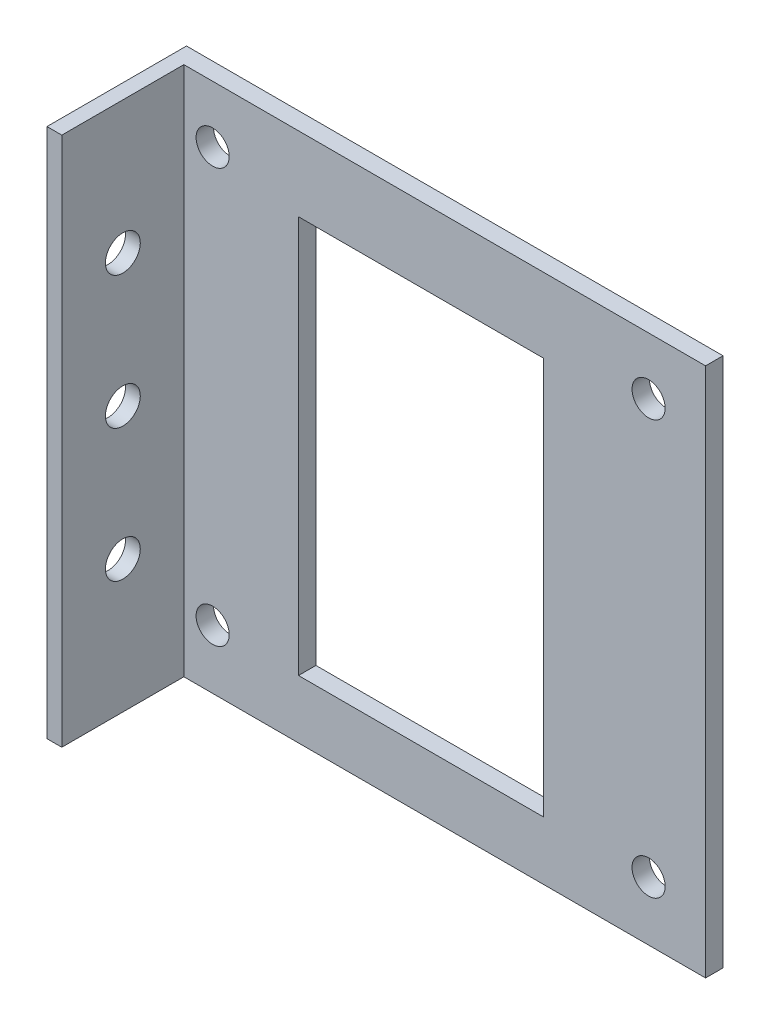
ISO-10303-21;
HEADER;
FILE_DESCRIPTION(('STEP AP214'),'2;1');
FILE_NAME('part.step','',(''),(''),'','','');
FILE_SCHEMA(('AUTOMOTIVE_DESIGN { 1 0 10303 214 1 1 1 1 }'));
ENDSEC;
DATA;
#1=APPLICATION_CONTEXT('core data for automotive mechanical design processes');
#2=APPLICATION_PROTOCOL_DEFINITION('international standard','automotive_design',2000,#1);
#3=PRODUCT_CONTEXT('',#1,'mechanical');
#4=PRODUCT('Part','Part','',(#3));
#5=PRODUCT_RELATED_PRODUCT_CATEGORY('part','',(#4));
#6=PRODUCT_DEFINITION_FORMATION('','',#4);
#7=PRODUCT_DEFINITION_CONTEXT('part definition',#1,'design');
#8=PRODUCT_DEFINITION('design','',#6,#7);
#9=PRODUCT_DEFINITION_SHAPE('','',#8);
#10=(LENGTH_UNIT() NAMED_UNIT(*) SI_UNIT(.MILLI.,.METRE.));
#11=(NAMED_UNIT(*) PLANE_ANGLE_UNIT() SI_UNIT($,.RADIAN.));
#12=(NAMED_UNIT(*) SI_UNIT($,.STERADIAN.) SOLID_ANGLE_UNIT());
#13=UNCERTAINTY_MEASURE_WITH_UNIT(LENGTH_MEASURE(1.E-05),#10,'distance_accuracy_value','');
#14=(GEOMETRIC_REPRESENTATION_CONTEXT(3) GLOBAL_UNCERTAINTY_ASSIGNED_CONTEXT((#13)) GLOBAL_UNIT_ASSIGNED_CONTEXT((#10,
#11,#12)) REPRESENTATION_CONTEXT('',''));
#15=CARTESIAN_POINT('',(0.,0.,0.));
#16=DIRECTION('',(0.,0.,1.));
#17=DIRECTION('',(1.,0.,0.));
#18=AXIS2_PLACEMENT_3D('',#15,#16,#17);
#19=CARTESIAN_POINT('',(0.,0.,2.54));
#20=DIRECTION('',(0.,0.,1.));
#21=DIRECTION('',(1.,0.,0.));
#22=AXIS2_PLACEMENT_3D('',#19,#20,#21);
#23=PLANE('',#22);
#24=DIRECTION('',(0.,1.,0.));
#25=VECTOR('',#24,1.);
#26=CARTESIAN_POINT('',(-30.4281386564607,30.9740668549754,2.54));
#27=LINE('',#26,#25);
#28=CARTESIAN_POINT('',(-30.4281386564607,-46.2479215736483,2.54));
#29=VERTEX_POINT('',#28);
#30=CARTESIAN_POINT('',(-30.4281386564607,30.9740668549754,2.54));
#31=VERTEX_POINT('',#30);
#32=EDGE_CURVE('E48',#29,#31,#27,.T.);
#33=ORIENTED_EDGE('',*,*,#32,.F.);
#34=DIRECTION('',(1.,0.,0.));
#35=VECTOR('',#34,1.);
#36=CARTESIAN_POINT('',(-32.5877369330817,-46.2479215736483,2.54));
#37=LINE('',#36,#35);
#38=CARTESIAN_POINT('',(45.5627179981381,-46.2479215736483,2.54));
#39=VERTEX_POINT('',#38);
#40=EDGE_CURVE('E195',#29,#39,#37,.T.);
#41=ORIENTED_EDGE('',*,*,#40,.T.);
#42=DIRECTION('',(0.,1.,0.));
#43=VECTOR('',#42,1.);
#44=CARTESIAN_POINT('',(45.5627179981381,30.9740668549754,2.54));
#45=LINE('',#44,#43);
#46=CARTESIAN_POINT('',(45.5627179981381,30.9740668549754,2.54));
#47=VERTEX_POINT('',#46);
#48=EDGE_CURVE('E197',#39,#47,#45,.T.);
#49=ORIENTED_EDGE('',*,*,#48,.T.);
#50=DIRECTION('',(-1.,0.,0.));
#51=VECTOR('',#50,1.);
#52=CARTESIAN_POINT('',(-32.5877369330817,30.9740668549754,2.54));
#53=LINE('',#52,#51);
#54=EDGE_CURVE('E200',#47,#31,#53,.T.);
#55=ORIENTED_EDGE('',*,*,#54,.T.);
#56=EDGE_LOOP('',(#33,#41,#49,#55));
#57=FACE_BOUND('',#56,.T.);
#58=CARTESIAN_POINT('',(-26.2377369595064,-37.6485441198693,2.54));
#59=DIRECTION('',(0.,0.,1.));
#60=DIRECTION('',(1.,0.,0.));
#61=AXIS2_PLACEMENT_3D('',#58,#59,#60);
#62=CIRCLE('',#61,2.41300000000534);
#63=CARTESIAN_POINT('',(-23.8247369595011,-37.6485441198693,2.54));
#64=VERTEX_POINT('',#63);
#65=EDGE_CURVE('E178',#64,#64,#62,.T.);
#66=ORIENTED_EDGE('',*,*,#65,.F.);
#67=EDGE_LOOP('',(#66));
#68=FACE_BOUND('',#67,.T.);
#69=CARTESIAN_POINT('',(37.2622630404935,22.6764558801306,2.54));
#70=DIRECTION('',(0.,0.,1.));
#71=DIRECTION('',(1.,0.,0.));
#72=AXIS2_PLACEMENT_3D('',#69,#70,#71);
#73=CIRCLE('',#72,2.41299999998956);
#74=CARTESIAN_POINT('',(39.6752630404831,22.6764558801306,2.54));
#75=VERTEX_POINT('',#74);
#76=EDGE_CURVE('E190',#75,#75,#73,.T.);
#77=ORIENTED_EDGE('',*,*,#76,.F.);
#78=EDGE_LOOP('',(#77));
#79=FACE_BOUND('',#78,.T.);
#80=CARTESIAN_POINT('',(37.2622630404935,-37.6485441198693,2.54));
#81=DIRECTION('',(0.,0.,1.));
#82=DIRECTION('',(1.,0.,0.));
#83=AXIS2_PLACEMENT_3D('',#80,#81,#82);
#84=CIRCLE('',#83,2.41300000000643);
#85=CARTESIAN_POINT('',(39.6752630405,-37.6485441198693,2.54));
#86=VERTEX_POINT('',#85);
#87=EDGE_CURVE('E184',#86,#86,#84,.T.);
#88=ORIENTED_EDGE('',*,*,#87,.F.);
#89=EDGE_LOOP('',(#88));
#90=FACE_BOUND('',#89,.T.);
#91=CARTESIAN_POINT('',(-26.2377369595064,22.6764558801306,2.54));
#92=DIRECTION('',(0.,0.,1.));
#93=DIRECTION('',(1.,0.,0.));
#94=AXIS2_PLACEMENT_3D('',#91,#92,#93);
#95=CIRCLE('',#94,2.41299999993067);
#96=CARTESIAN_POINT('',(-23.8247369595758,22.6764558801306,2.54));
#97=VERTEX_POINT('',#96);
#98=EDGE_CURVE('E172',#97,#97,#95,.T.);
#99=ORIENTED_EDGE('',*,*,#98,.F.);
#100=EDGE_LOOP('',(#99));
#101=FACE_BOUND('',#100,.T.);
#102=DIRECTION('',(-1.,0.,0.));
#103=VECTOR('',#102,1.);
#104=CARTESIAN_POINT('',(21.9184982405309,20.1358999691804,2.54));
#105=LINE('',#104,#103);
#106=CARTESIAN_POINT('',(21.9184982405309,20.1358999691804,2.54));
#107=VERTEX_POINT('',#106);
#108=CARTESIAN_POINT('',(-13.734240403043,20.1358999691804,2.54));
#109=VERTEX_POINT('',#108);
#110=EDGE_CURVE('E145',#107,#109,#105,.T.);
#111=ORIENTED_EDGE('',*,*,#110,.F.);
#112=DIRECTION('',(0.,1.,0.));
#113=VECTOR('',#112,1.);
#114=CARTESIAN_POINT('',(21.9184982405309,-37.7383856681526,2.54));
#115=LINE('',#114,#113);
#116=CARTESIAN_POINT('',(21.9184982405309,-37.7383856681526,2.54));
#117=VERTEX_POINT('',#116);
#118=EDGE_CURVE('E143',#117,#107,#115,.T.);
#119=ORIENTED_EDGE('',*,*,#118,.F.);
#120=DIRECTION('',(1.,0.,0.));
#121=VECTOR('',#120,1.);
#122=CARTESIAN_POINT('',(21.9184982405309,-37.7383856681526,2.54));
#123=LINE('',#122,#121);
#124=CARTESIAN_POINT('',(-13.734240403043,-37.7383856681526,2.54));
#125=VERTEX_POINT('',#124);
#126=EDGE_CURVE('E150',#125,#117,#123,.T.);
#127=ORIENTED_EDGE('',*,*,#126,.F.);
#128=DIRECTION('',(0.,-1.,0.));
#129=VECTOR('',#128,1.);
#130=CARTESIAN_POINT('',(-13.734240403043,-37.7383856681526,2.54));
#131=LINE('',#130,#129);
#132=EDGE_CURVE('E148',#109,#125,#131,.T.);
#133=ORIENTED_EDGE('',*,*,#132,.F.);
#134=EDGE_LOOP('',(#111,#119,#127,#133));
#135=FACE_BOUND('',#134,.T.);
#136=ADVANCED_FACE('F33',(#57,#68,#79,#90,#101,#135),#23,.T.);
#137=CARTESIAN_POINT('',(0.,0.,0.));
#138=DIRECTION('',(0.,0.,1.));
#139=DIRECTION('',(1.,0.,0.));
#140=AXIS2_PLACEMENT_3D('',#137,#138,#139);
#141=PLANE('',#140);
#142=CARTESIAN_POINT('',(-26.2377369595064,22.6764558801306,0.));
#143=DIRECTION('',(0.,0.,1.));
#144=DIRECTION('',(1.,0.,0.));
#145=AXIS2_PLACEMENT_3D('',#142,#143,#144);
#146=CIRCLE('',#145,2.41299999993067);
#147=CARTESIAN_POINT('',(-23.8247369595758,22.6764558801306,0.));
#148=VERTEX_POINT('',#147);
#149=EDGE_CURVE('E171',#148,#148,#146,.T.);
#150=ORIENTED_EDGE('',*,*,#149,.T.);
#151=EDGE_LOOP('',(#150));
#152=FACE_BOUND('',#151,.T.);
#153=CARTESIAN_POINT('',(-26.2377369595064,-37.6485441198693,0.));
#154=DIRECTION('',(0.,0.,1.));
#155=DIRECTION('',(1.,0.,0.));
#156=AXIS2_PLACEMENT_3D('',#153,#154,#155);
#157=CIRCLE('',#156,2.41300000000534);
#158=CARTESIAN_POINT('',(-23.8247369595011,-37.6485441198693,0.));
#159=VERTEX_POINT('',#158);
#160=EDGE_CURVE('E175',#159,#159,#157,.T.);
#161=ORIENTED_EDGE('',*,*,#160,.T.);
#162=EDGE_LOOP('',(#161));
#163=FACE_BOUND('',#162,.T.);
#164=CARTESIAN_POINT('',(37.2622630404935,-37.6485441198693,0.));
#165=DIRECTION('',(0.,0.,1.));
#166=DIRECTION('',(1.,0.,0.));
#167=AXIS2_PLACEMENT_3D('',#164,#165,#166);
#168=CIRCLE('',#167,2.41300000000643);
#169=CARTESIAN_POINT('',(39.6752630405,-37.6485441198693,0.));
#170=VERTEX_POINT('',#169);
#171=EDGE_CURVE('E181',#170,#170,#168,.T.);
#172=ORIENTED_EDGE('',*,*,#171,.T.);
#173=EDGE_LOOP('',(#172));
#174=FACE_BOUND('',#173,.T.);
#175=CARTESIAN_POINT('',(37.2622630404935,22.6764558801306,0.));
#176=DIRECTION('',(0.,0.,1.));
#177=DIRECTION('',(1.,0.,0.));
#178=AXIS2_PLACEMENT_3D('',#175,#176,#177);
#179=CIRCLE('',#178,2.41299999998956);
#180=CARTESIAN_POINT('',(39.6752630404831,22.6764558801306,0.));
#181=VERTEX_POINT('',#180);
#182=EDGE_CURVE('E187',#181,#181,#179,.T.);
#183=ORIENTED_EDGE('',*,*,#182,.T.);
#184=EDGE_LOOP('',(#183));
#185=FACE_BOUND('',#184,.T.);
#186=DIRECTION('',(0.,-1.,0.));
#187=VECTOR('',#186,1.);
#188=CARTESIAN_POINT('',(-32.5877369330817,30.9740668549754,0.));
#189=LINE('',#188,#187);
#190=CARTESIAN_POINT('',(-32.5877369330817,30.9740668549754,0.));
#191=VERTEX_POINT('',#190);
#192=CARTESIAN_POINT('',(-32.5877369330817,-46.2479215736483,0.));
#193=VERTEX_POINT('',#192);
#194=EDGE_CURVE('E115',#191,#193,#189,.T.);
#195=ORIENTED_EDGE('',*,*,#194,.F.);
#196=DIRECTION('',(-1.,0.,0.));
#197=VECTOR('',#196,1.);
#198=CARTESIAN_POINT('',(-32.5877369330817,30.9740668549754,0.));
#199=LINE('',#198,#197);
#200=CARTESIAN_POINT('',(45.5627179981381,30.9740668549754,0.));
#201=VERTEX_POINT('',#200);
#202=EDGE_CURVE('E198',#201,#191,#199,.T.);
#203=ORIENTED_EDGE('',*,*,#202,.F.);
#204=DIRECTION('',(0.,1.,0.));
#205=VECTOR('',#204,1.);
#206=CARTESIAN_POINT('',(45.5627179981381,30.9740668549754,0.));
#207=LINE('',#206,#205);
#208=CARTESIAN_POINT('',(45.5627179981381,-46.2479215736483,0.));
#209=VERTEX_POINT('',#208);
#210=EDGE_CURVE('E206',#209,#201,#207,.T.);
#211=ORIENTED_EDGE('',*,*,#210,.F.);
#212=DIRECTION('',(1.,0.,0.));
#213=VECTOR('',#212,1.);
#214=CARTESIAN_POINT('',(-32.5877369330817,-46.2479215736483,0.));
#215=LINE('',#214,#213);
#216=EDGE_CURVE('E204',#193,#209,#215,.T.);
#217=ORIENTED_EDGE('',*,*,#216,.F.);
#218=EDGE_LOOP('',(#195,#203,#211,#217));
#219=FACE_BOUND('',#218,.T.);
#220=DIRECTION('',(0.,1.,0.));
#221=VECTOR('',#220,1.);
#222=CARTESIAN_POINT('',(21.9184982405309,-37.7383856681526,0.));
#223=LINE('',#222,#221);
#224=CARTESIAN_POINT('',(21.9184982405309,-37.7383856681526,0.));
#225=VERTEX_POINT('',#224);
#226=CARTESIAN_POINT('',(21.9184982405309,20.1358999691804,0.));
#227=VERTEX_POINT('',#226);
#228=EDGE_CURVE('E142',#225,#227,#223,.T.);
#229=ORIENTED_EDGE('',*,*,#228,.T.);
#230=DIRECTION('',(-1.,0.,0.));
#231=VECTOR('',#230,1.);
#232=CARTESIAN_POINT('',(21.9184982405309,20.1358999691804,0.));
#233=LINE('',#232,#231);
#234=CARTESIAN_POINT('',(-13.734240403043,20.1358999691804,0.));
#235=VERTEX_POINT('',#234);
#236=EDGE_CURVE('E155',#227,#235,#233,.T.);
#237=ORIENTED_EDGE('',*,*,#236,.T.);
#238=DIRECTION('',(0.,-1.,0.));
#239=VECTOR('',#238,1.);
#240=CARTESIAN_POINT('',(-13.734240403043,-37.7383856681526,0.));
#241=LINE('',#240,#239);
#242=CARTESIAN_POINT('',(-13.734240403043,-37.7383856681526,0.));
#243=VERTEX_POINT('',#242);
#244=EDGE_CURVE('E158',#235,#243,#241,.T.);
#245=ORIENTED_EDGE('',*,*,#244,.T.);
#246=DIRECTION('',(1.,0.,0.));
#247=VECTOR('',#246,1.);
#248=CARTESIAN_POINT('',(21.9184982405309,-37.7383856681526,0.));
#249=LINE('',#248,#247);
#250=EDGE_CURVE('E146',#243,#225,#249,.T.);
#251=ORIENTED_EDGE('',*,*,#250,.T.);
#252=EDGE_LOOP('',(#229,#237,#245,#251));
#253=FACE_BOUND('',#252,.T.);
#254=ADVANCED_FACE('F221',(#152,#163,#174,#185,#219,#253),#141,.F.);
#255=CARTESIAN_POINT('',(-32.5877369330817,30.9740668549754,2.54));
#256=DIRECTION('',(1.,0.,0.));
#257=DIRECTION('',(0.,1.,0.));
#258=AXIS2_PLACEMENT_3D('',#255,#256,#257);
#259=PLANE('',#258);
#260=CARTESIAN_POINT('',(-32.5877369330817,-26.9424244664924,11.43));
#261=DIRECTION('',(1.,0.,0.));
#262=DIRECTION('',(0.,1.,0.));
#263=AXIS2_PLACEMENT_3D('',#260,#261,#262);
#264=CIRCLE('',#263,2.54);
#265=CARTESIAN_POINT('',(-32.5877369330817,-24.4024244664924,11.43));
#266=VERTEX_POINT('',#265);
#267=EDGE_CURVE('E131',#266,#266,#264,.T.);
#268=ORIENTED_EDGE('',*,*,#267,.T.);
#269=EDGE_LOOP('',(#268));
#270=FACE_BOUND('',#269,.T.);
#271=CARTESIAN_POINT('',(-32.5877369330817,11.6685697478194,11.43));
#272=DIRECTION('',(1.,0.,0.));
#273=DIRECTION('',(0.,1.,0.));
#274=AXIS2_PLACEMENT_3D('',#271,#272,#273);
#275=CIRCLE('',#274,2.54);
#276=CARTESIAN_POINT('',(-32.5877369330817,14.2085697478194,11.43));
#277=VERTEX_POINT('',#276);
#278=EDGE_CURVE('E271',#277,#277,#275,.T.);
#279=ORIENTED_EDGE('',*,*,#278,.T.);
#280=EDGE_LOOP('',(#279));
#281=FACE_BOUND('',#280,.T.);
#282=CARTESIAN_POINT('',(-32.5877369330817,-7.63692735933649,11.43));
#283=DIRECTION('',(1.,0.,0.));
#284=DIRECTION('',(0.,1.,0.));
#285=AXIS2_PLACEMENT_3D('',#282,#283,#284);
#286=CIRCLE('',#285,2.54);
#287=CARTESIAN_POINT('',(-32.5877369330817,-5.09692735933649,11.43));
#288=VERTEX_POINT('',#287);
#289=EDGE_CURVE('E274',#288,#288,#286,.T.);
#290=ORIENTED_EDGE('',*,*,#289,.T.);
#291=EDGE_LOOP('',(#290));
#292=FACE_BOUND('',#291,.T.);
#293=ORIENTED_EDGE('',*,*,#194,.T.);
#294=DIRECTION('',(0.,0.,-1.));
#295=VECTOR('',#294,1.);
#296=CARTESIAN_POINT('',(-32.5877369330817,-46.2479215736483,2.54));
#297=LINE('',#296,#295);
#298=CARTESIAN_POINT('',(-32.5877369330817,-46.2479215736483,20.32));
#299=VERTEX_POINT('',#298);
#300=EDGE_CURVE('E11',#299,#193,#297,.T.);
#301=ORIENTED_EDGE('',*,*,#300,.F.);
#302=DIRECTION('',(0.,-1.,0.));
#303=VECTOR('',#302,1.);
#304=CARTESIAN_POINT('',(-32.5877369330817,30.9740668549754,20.32));
#305=LINE('',#304,#303);
#306=CARTESIAN_POINT('',(-32.5877369330817,30.9740668549754,20.32));
#307=VERTEX_POINT('',#306);
#308=EDGE_CURVE('E113',#307,#299,#305,.T.);
#309=ORIENTED_EDGE('',*,*,#308,.F.);
#310=DIRECTION('',(0.,0.,-1.));
#311=VECTOR('',#310,1.);
#312=CARTESIAN_POINT('',(-32.5877369330817,30.9740668549754,2.54));
#313=LINE('',#312,#311);
#314=EDGE_CURVE('E202',#307,#191,#313,.T.);
#315=ORIENTED_EDGE('',*,*,#314,.T.);
#316=EDGE_LOOP('',(#293,#301,#309,#315));
#317=FACE_BOUND('',#316,.T.);
#318=ADVANCED_FACE('F35',(#270,#281,#292,#317),#259,.F.);
#319=CARTESIAN_POINT('',(-32.5877369330817,-46.2479215736483,2.54));
#320=DIRECTION('',(0.,1.,0.));
#321=DIRECTION('',(0.,0.,1.));
#322=AXIS2_PLACEMENT_3D('',#319,#320,#321);
#323=PLANE('',#322);
#324=ORIENTED_EDGE('',*,*,#216,.T.);
#325=DIRECTION('',(0.,0.,-1.));
#326=VECTOR('',#325,1.);
#327=CARTESIAN_POINT('',(45.5627179981381,-46.2479215736483,2.54));
#328=LINE('',#327,#326);
#329=EDGE_CURVE('E41',#39,#209,#328,.T.);
#330=ORIENTED_EDGE('',*,*,#329,.F.);
#331=ORIENTED_EDGE('',*,*,#40,.F.);
#332=DIRECTION('',(0.,0.,-1.));
#333=VECTOR('',#332,1.);
#334=CARTESIAN_POINT('',(-30.4281386564607,-46.2479215736483,20.32));
#335=LINE('',#334,#333);
#336=CARTESIAN_POINT('',(-30.4281386564607,-46.2479215736483,20.32));
#337=VERTEX_POINT('',#336);
#338=EDGE_CURVE('E121',#337,#29,#335,.T.);
#339=ORIENTED_EDGE('',*,*,#338,.F.);
#340=DIRECTION('',(1.,0.,0.));
#341=VECTOR('',#340,1.);
#342=CARTESIAN_POINT('',(-32.5877369330817,-46.2479215736483,20.32));
#343=LINE('',#342,#341);
#344=EDGE_CURVE('E118',#299,#337,#343,.T.);
#345=ORIENTED_EDGE('',*,*,#344,.F.);
#346=ORIENTED_EDGE('',*,*,#300,.T.);
#347=EDGE_LOOP('',(#324,#330,#331,#339,#345,#346));
#348=FACE_BOUND('',#347,.T.);
#349=ADVANCED_FACE('F119',(#348),#323,.F.);
#350=CARTESIAN_POINT('',(45.5627179981381,30.9740668549754,2.54));
#351=DIRECTION('',(-1.,0.,0.));
#352=DIRECTION('',(0.,-1.,0.));
#353=AXIS2_PLACEMENT_3D('',#350,#351,#352);
#354=PLANE('',#353);
#355=ORIENTED_EDGE('',*,*,#210,.T.);
#356=DIRECTION('',(0.,0.,-1.));
#357=VECTOR('',#356,1.);
#358=CARTESIAN_POINT('',(45.5627179981381,30.9740668549754,2.54));
#359=LINE('',#358,#357);
#360=EDGE_CURVE('E210',#47,#201,#359,.T.);
#361=ORIENTED_EDGE('',*,*,#360,.F.);
#362=ORIENTED_EDGE('',*,*,#48,.F.);
#363=ORIENTED_EDGE('',*,*,#329,.T.);
#364=EDGE_LOOP('',(#355,#361,#362,#363));
#365=FACE_BOUND('',#364,.T.);
#366=ADVANCED_FACE('F217',(#365),#354,.F.);
#367=CARTESIAN_POINT('',(-32.5877369330817,30.9740668549754,2.54));
#368=DIRECTION('',(0.,-1.,0.));
#369=DIRECTION('',(0.,0.,-1.));
#370=AXIS2_PLACEMENT_3D('',#367,#368,#369);
#371=PLANE('',#370);
#372=ORIENTED_EDGE('',*,*,#202,.T.);
#373=ORIENTED_EDGE('',*,*,#314,.F.);
#374=DIRECTION('',(-1.,0.,0.));
#375=VECTOR('',#374,1.);
#376=CARTESIAN_POINT('',(-32.5877369330817,30.9740668549754,20.32));
#377=LINE('',#376,#375);
#378=CARTESIAN_POINT('',(-30.4281386564607,30.9740668549754,20.32));
#379=VERTEX_POINT('',#378);
#380=EDGE_CURVE('E129',#379,#307,#377,.T.);
#381=ORIENTED_EDGE('',*,*,#380,.F.);
#382=DIRECTION('',(0.,0.,-1.));
#383=VECTOR('',#382,1.);
#384=CARTESIAN_POINT('',(-30.4281386564607,30.9740668549754,20.32));
#385=LINE('',#384,#383);
#386=EDGE_CURVE('E137',#379,#31,#385,.T.);
#387=ORIENTED_EDGE('',*,*,#386,.T.);
#388=ORIENTED_EDGE('',*,*,#54,.F.);
#389=ORIENTED_EDGE('',*,*,#360,.T.);
#390=EDGE_LOOP('',(#372,#373,#381,#387,#388,#389));
#391=FACE_BOUND('',#390,.T.);
#392=ADVANCED_FACE('F224',(#391),#371,.F.);
#393=CARTESIAN_POINT('',(37.2622630404935,22.6764558801306,2.54));
#394=DIRECTION('',(0.,0.,-1.));
#395=DIRECTION('',(-1.,0.,0.));
#396=AXIS2_PLACEMENT_3D('',#393,#394,#395);
#397=CYLINDRICAL_SURFACE('',#396,2.41299999998956);
#398=ORIENTED_EDGE('',*,*,#76,.T.);
#399=EDGE_LOOP('',(#398));
#400=FACE_BOUND('',#399,.T.);
#401=ORIENTED_EDGE('',*,*,#182,.F.);
#402=EDGE_LOOP('',(#401));
#403=FACE_BOUND('',#402,.T.);
#404=ADVANCED_FACE('F252',(#400,#403),#397,.F.);
#405=CARTESIAN_POINT('',(37.2622630404935,-37.6485441198693,2.54));
#406=DIRECTION('',(0.,0.,-1.));
#407=DIRECTION('',(-1.,0.,0.));
#408=AXIS2_PLACEMENT_3D('',#405,#406,#407);
#409=CYLINDRICAL_SURFACE('',#408,2.41300000000643);
#410=ORIENTED_EDGE('',*,*,#87,.T.);
#411=EDGE_LOOP('',(#410));
#412=FACE_BOUND('',#411,.T.);
#413=ORIENTED_EDGE('',*,*,#171,.F.);
#414=EDGE_LOOP('',(#413));
#415=FACE_BOUND('',#414,.T.);
#416=ADVANCED_FACE('F402',(#412,#415),#409,.F.);
#417=CARTESIAN_POINT('',(-26.2377369595064,-37.6485441198693,2.54));
#418=DIRECTION('',(0.,0.,-1.));
#419=DIRECTION('',(-1.,0.,0.));
#420=AXIS2_PLACEMENT_3D('',#417,#418,#419);
#421=CYLINDRICAL_SURFACE('',#420,2.41300000000534);
#422=ORIENTED_EDGE('',*,*,#65,.T.);
#423=EDGE_LOOP('',(#422));
#424=FACE_BOUND('',#423,.T.);
#425=ORIENTED_EDGE('',*,*,#160,.F.);
#426=EDGE_LOOP('',(#425));
#427=FACE_BOUND('',#426,.T.);
#428=ADVANCED_FACE('F392',(#424,#427),#421,.F.);
#429=CARTESIAN_POINT('',(-26.2377369595064,22.6764558801306,2.54));
#430=DIRECTION('',(0.,0.,-1.));
#431=DIRECTION('',(-1.,0.,0.));
#432=AXIS2_PLACEMENT_3D('',#429,#430,#431);
#433=CYLINDRICAL_SURFACE('',#432,2.41299999993067);
#434=ORIENTED_EDGE('',*,*,#98,.T.);
#435=EDGE_LOOP('',(#434));
#436=FACE_BOUND('',#435,.T.);
#437=ORIENTED_EDGE('',*,*,#149,.F.);
#438=EDGE_LOOP('',(#437));
#439=FACE_BOUND('',#438,.T.);
#440=ADVANCED_FACE('F382',(#436,#439),#433,.F.);
#441=CARTESIAN_POINT('',(21.9184982405309,-37.7383856681526,2.54));
#442=DIRECTION('',(-1.,0.,0.));
#443=DIRECTION('',(0.,0.,1.));
#444=AXIS2_PLACEMENT_3D('',#441,#442,#443);
#445=PLANE('',#444);
#446=ORIENTED_EDGE('',*,*,#228,.F.);
#447=DIRECTION('',(0.,0.,-1.));
#448=VECTOR('',#447,1.);
#449=CARTESIAN_POINT('',(21.9184982405309,-37.7383856681526,2.54));
#450=LINE('',#449,#448);
#451=EDGE_CURVE('E152',#117,#225,#450,.T.);
#452=ORIENTED_EDGE('',*,*,#451,.F.);
#453=ORIENTED_EDGE('',*,*,#118,.T.);
#454=DIRECTION('',(0.,0.,-1.));
#455=VECTOR('',#454,1.);
#456=CARTESIAN_POINT('',(21.9184982405309,20.1358999691804,2.54));
#457=LINE('',#456,#455);
#458=EDGE_CURVE('E168',#107,#227,#457,.T.);
#459=ORIENTED_EDGE('',*,*,#458,.T.);
#460=EDGE_LOOP('',(#446,#452,#453,#459));
#461=FACE_BOUND('',#460,.T.);
#462=ADVANCED_FACE('F372',(#461),#445,.T.);
#463=CARTESIAN_POINT('',(21.9184982405309,20.1358999691804,2.54));
#464=DIRECTION('',(0.,-1.,0.));
#465=DIRECTION('',(0.,0.,-1.));
#466=AXIS2_PLACEMENT_3D('',#463,#464,#465);
#467=PLANE('',#466);
#468=ORIENTED_EDGE('',*,*,#236,.F.);
#469=ORIENTED_EDGE('',*,*,#458,.F.);
#470=ORIENTED_EDGE('',*,*,#110,.T.);
#471=DIRECTION('',(0.,0.,-1.));
#472=VECTOR('',#471,1.);
#473=CARTESIAN_POINT('',(-13.734240403043,20.1358999691804,2.54));
#474=LINE('',#473,#472);
#475=EDGE_CURVE('E166',#109,#235,#474,.T.);
#476=ORIENTED_EDGE('',*,*,#475,.T.);
#477=EDGE_LOOP('',(#468,#469,#470,#476));
#478=FACE_BOUND('',#477,.T.);
#479=ADVANCED_FACE('F362',(#478),#467,.T.);
#480=CARTESIAN_POINT('',(-13.734240403043,-37.7383856681526,2.54));
#481=DIRECTION('',(1.,0.,0.));
#482=DIRECTION('',(0.,0.,-1.));
#483=AXIS2_PLACEMENT_3D('',#480,#481,#482);
#484=PLANE('',#483);
#485=ORIENTED_EDGE('',*,*,#244,.F.);
#486=ORIENTED_EDGE('',*,*,#475,.F.);
#487=ORIENTED_EDGE('',*,*,#132,.T.);
#488=DIRECTION('',(0.,0.,-1.));
#489=VECTOR('',#488,1.);
#490=CARTESIAN_POINT('',(-13.734240403043,-37.7383856681526,2.54));
#491=LINE('',#490,#489);
#492=EDGE_CURVE('E56',#125,#243,#491,.T.);
#493=ORIENTED_EDGE('',*,*,#492,.T.);
#494=EDGE_LOOP('',(#485,#486,#487,#493));
#495=FACE_BOUND('',#494,.T.);
#496=ADVANCED_FACE('F240',(#495),#484,.T.);
#497=CARTESIAN_POINT('',(21.9184982405309,-37.7383856681526,2.54));
#498=DIRECTION('',(0.,1.,0.));
#499=DIRECTION('',(0.,0.,1.));
#500=AXIS2_PLACEMENT_3D('',#497,#498,#499);
#501=PLANE('',#500);
#502=ORIENTED_EDGE('',*,*,#250,.F.);
#503=ORIENTED_EDGE('',*,*,#492,.F.);
#504=ORIENTED_EDGE('',*,*,#126,.T.);
#505=ORIENTED_EDGE('',*,*,#451,.T.);
#506=EDGE_LOOP('',(#502,#503,#504,#505));
#507=FACE_BOUND('',#506,.T.);
#508=ADVANCED_FACE('F231',(#507),#501,.T.);
#509=CARTESIAN_POINT('',(-30.4281386564607,30.9740668549754,20.32));
#510=DIRECTION('',(-1.,0.,0.));
#511=DIRECTION('',(0.,-1.,0.));
#512=AXIS2_PLACEMENT_3D('',#509,#510,#511);
#513=PLANE('',#512);
#514=CARTESIAN_POINT('',(-30.4281386564607,-26.9424244664924,11.43));
#515=DIRECTION('',(1.,0.,0.));
#516=DIRECTION('',(0.,-1.,0.));
#517=AXIS2_PLACEMENT_3D('',#514,#515,#516);
#518=CIRCLE('',#517,2.54);
#519=CARTESIAN_POINT('',(-30.4281386564607,-29.4824244664924,11.43));
#520=VERTEX_POINT('',#519);
#521=EDGE_CURVE('E282',#520,#520,#518,.T.);
#522=ORIENTED_EDGE('',*,*,#521,.F.);
#523=EDGE_LOOP('',(#522));
#524=FACE_BOUND('',#523,.T.);
#525=CARTESIAN_POINT('',(-30.4281386564607,11.6685697478194,11.43));
#526=DIRECTION('',(1.,0.,0.));
#527=DIRECTION('',(0.,1.,0.));
#528=AXIS2_PLACEMENT_3D('',#525,#526,#527);
#529=CIRCLE('',#528,2.54);
#530=CARTESIAN_POINT('',(-30.4281386564607,14.2085697478194,11.43));
#531=VERTEX_POINT('',#530);
#532=EDGE_CURVE('E279',#531,#531,#529,.T.);
#533=ORIENTED_EDGE('',*,*,#532,.F.);
#534=EDGE_LOOP('',(#533));
#535=FACE_BOUND('',#534,.T.);
#536=CARTESIAN_POINT('',(-30.4281386564607,-7.63692735933649,11.43));
#537=DIRECTION('',(1.,0.,0.));
#538=DIRECTION('',(0.,1.,0.));
#539=AXIS2_PLACEMENT_3D('',#536,#537,#538);
#540=CIRCLE('',#539,2.54);
#541=CARTESIAN_POINT('',(-30.4281386564607,-5.09692735933649,11.43));
#542=VERTEX_POINT('',#541);
#543=EDGE_CURVE('E276',#542,#542,#540,.T.);
#544=ORIENTED_EDGE('',*,*,#543,.F.);
#545=EDGE_LOOP('',(#544));
#546=FACE_BOUND('',#545,.T.);
#547=ORIENTED_EDGE('',*,*,#32,.T.);
#548=ORIENTED_EDGE('',*,*,#386,.F.);
#549=DIRECTION('',(0.,1.,0.));
#550=VECTOR('',#549,1.);
#551=CARTESIAN_POINT('',(-30.4281386564607,30.9740668549754,20.32));
#552=LINE('',#551,#550);
#553=EDGE_CURVE('E124',#337,#379,#552,.T.);
#554=ORIENTED_EDGE('',*,*,#553,.F.);
#555=ORIENTED_EDGE('',*,*,#338,.T.);
#556=EDGE_LOOP('',(#547,#548,#554,#555));
#557=FACE_BOUND('',#556,.T.);
#558=ADVANCED_FACE('F229',(#524,#535,#546,#557),#513,.F.);
#559=CARTESIAN_POINT('',(0.,0.,20.32));
#560=DIRECTION('',(0.,0.,1.));
#561=DIRECTION('',(1.,0.,0.));
#562=AXIS2_PLACEMENT_3D('',#559,#560,#561);
#563=PLANE('',#562);
#564=ORIENTED_EDGE('',*,*,#308,.T.);
#565=ORIENTED_EDGE('',*,*,#344,.T.);
#566=ORIENTED_EDGE('',*,*,#553,.T.);
#567=ORIENTED_EDGE('',*,*,#380,.T.);
#568=EDGE_LOOP('',(#564,#565,#566,#567));
#569=FACE_BOUND('',#568,.T.);
#570=ADVANCED_FACE('F127',(#569),#563,.T.);
#571=CARTESIAN_POINT('',(-48.2081386564607,-7.6369273593365,11.43));
#572=DIRECTION('',(1.,0.,0.));
#573=DIRECTION('',(0.,1.,0.));
#574=AXIS2_PLACEMENT_3D('',#571,#572,#573);
#575=CYLINDRICAL_SURFACE('',#574,2.54);
#576=ORIENTED_EDGE('',*,*,#543,.T.);
#577=EDGE_LOOP('',(#576));
#578=FACE_BOUND('',#577,.T.);
#579=ORIENTED_EDGE('',*,*,#289,.F.);
#580=EDGE_LOOP('',(#579));
#581=FACE_BOUND('',#580,.T.);
#582=ADVANCED_FACE('F238',(#578,#581),#575,.F.);
#583=CARTESIAN_POINT('',(-48.2081386564607,11.6685697478194,11.43));
#584=DIRECTION('',(1.,0.,0.));
#585=DIRECTION('',(0.,1.,0.));
#586=AXIS2_PLACEMENT_3D('',#583,#584,#585);
#587=CYLINDRICAL_SURFACE('',#586,2.54);
#588=ORIENTED_EDGE('',*,*,#532,.T.);
#589=EDGE_LOOP('',(#588));
#590=FACE_BOUND('',#589,.T.);
#591=ORIENTED_EDGE('',*,*,#278,.F.);
#592=EDGE_LOOP('',(#591));
#593=FACE_BOUND('',#592,.T.);
#594=ADVANCED_FACE('F288',(#590,#593),#587,.F.);
#595=CARTESIAN_POINT('',(-48.2081386564607,-26.9424244664924,11.43));
#596=DIRECTION('',(1.,0.,0.));
#597=DIRECTION('',(0.,1.,0.));
#598=AXIS2_PLACEMENT_3D('',#595,#596,#597);
#599=CYLINDRICAL_SURFACE('',#598,2.54);
#600=ORIENTED_EDGE('',*,*,#521,.T.);
#601=EDGE_LOOP('',(#600));
#602=FACE_BOUND('',#601,.T.);
#603=ORIENTED_EDGE('',*,*,#267,.F.);
#604=EDGE_LOOP('',(#603));
#605=FACE_BOUND('',#604,.T.);
#606=ADVANCED_FACE('F298',(#602,#605),#599,.F.);
#607=CLOSED_SHELL('',(#136,#254,#318,#349,#366,#392,#404,#416,#428,#440,#462,#479,#496,#508,
#558,#570,#582,#594,#606));
#608=MANIFOLD_SOLID_BREP('B2',#607);
#609=ADVANCED_BREP_SHAPE_REPRESENTATION('',(#18,#608),#14);
#610=SHAPE_DEFINITION_REPRESENTATION(#9,#609);
ENDSEC;
END-ISO-10303-21;
